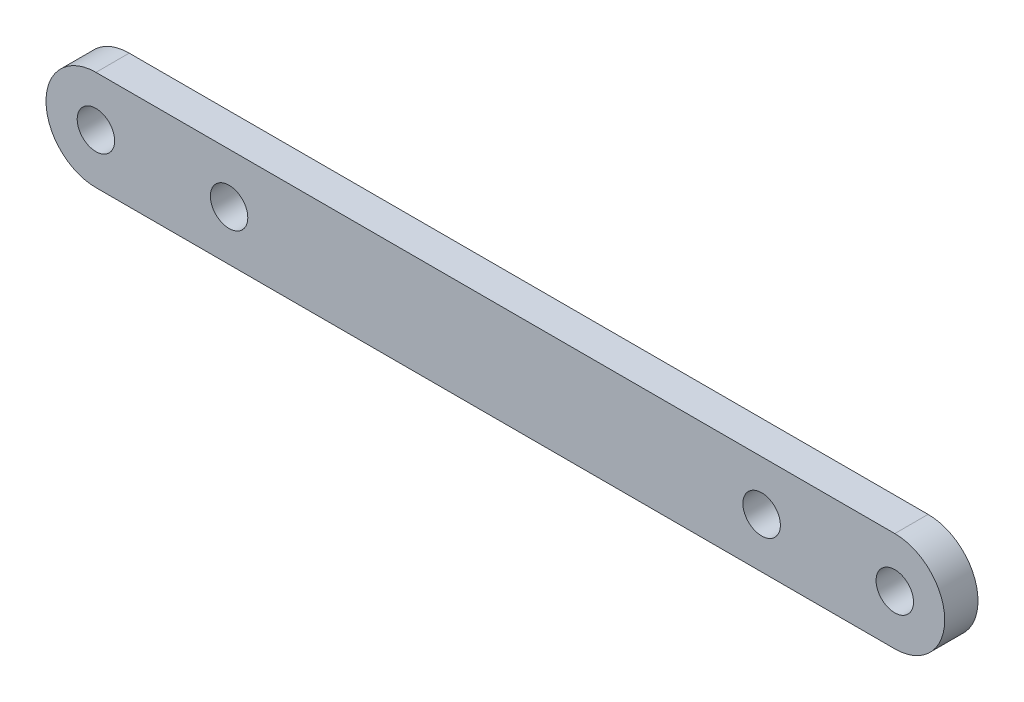
ISO-10303-21;
HEADER;
FILE_DESCRIPTION(('STEP AP214'),'2;1');
FILE_NAME('part.step','',(''),(''),'','','');
FILE_SCHEMA(('AUTOMOTIVE_DESIGN { 1 0 10303 214 1 1 1 1 }'));
ENDSEC;
DATA;
#1=APPLICATION_CONTEXT('core data for automotive mechanical design processes');
#2=APPLICATION_PROTOCOL_DEFINITION('international standard','automotive_design',2000,#1);
#3=PRODUCT_CONTEXT('',#1,'mechanical');
#4=PRODUCT('Part','Part','',(#3));
#5=PRODUCT_RELATED_PRODUCT_CATEGORY('part','',(#4));
#6=PRODUCT_DEFINITION_FORMATION('','',#4);
#7=PRODUCT_DEFINITION_CONTEXT('part definition',#1,'design');
#8=PRODUCT_DEFINITION('design','',#6,#7);
#9=PRODUCT_DEFINITION_SHAPE('','',#8);
#10=(LENGTH_UNIT() NAMED_UNIT(*) SI_UNIT(.MILLI.,.METRE.));
#11=(NAMED_UNIT(*) PLANE_ANGLE_UNIT() SI_UNIT($,.RADIAN.));
#12=(NAMED_UNIT(*) SI_UNIT($,.STERADIAN.) SOLID_ANGLE_UNIT());
#13=UNCERTAINTY_MEASURE_WITH_UNIT(LENGTH_MEASURE(1.E-05),#10,'distance_accuracy_value','');
#14=(GEOMETRIC_REPRESENTATION_CONTEXT(3) GLOBAL_UNCERTAINTY_ASSIGNED_CONTEXT((#13)) GLOBAL_UNIT_ASSIGNED_CONTEXT((#10,
#11,#12)) REPRESENTATION_CONTEXT('',''));
#15=CARTESIAN_POINT('',(0.,0.,0.));
#16=DIRECTION('',(0.,0.,1.));
#17=DIRECTION('',(1.,0.,0.));
#18=AXIS2_PLACEMENT_3D('',#15,#16,#17);
#19=CARTESIAN_POINT('',(0.,0.,3.175));
#20=DIRECTION('',(0.,0.,-1.));
#21=DIRECTION('',(-1.,0.,0.));
#22=AXIS2_PLACEMENT_3D('',#19,#20,#21);
#23=CYLINDRICAL_SURFACE('',#22,4.7625);
#24=CARTESIAN_POINT('',(0.,0.,0.));
#25=DIRECTION('',(0.,0.,1.));
#26=DIRECTION('',(1.,0.,0.));
#27=AXIS2_PLACEMENT_3D('',#24,#25,#26);
#28=CIRCLE('',#27,4.7625);
#29=CARTESIAN_POINT('',(0.,-4.7625,0.));
#30=VERTEX_POINT('',#29);
#31=CARTESIAN_POINT('',(0.,4.7625,0.));
#32=VERTEX_POINT('',#31);
#33=EDGE_CURVE('E95',#30,#32,#28,.T.);
#34=ORIENTED_EDGE('',*,*,#33,.T.);
#35=DIRECTION('',(0.,0.,-1.));
#36=VECTOR('',#35,1.);
#37=CARTESIAN_POINT('',(0.,4.7625,3.175));
#38=LINE('',#37,#36);
#39=CARTESIAN_POINT('',(0.,4.7625,3.175));
#40=VERTEX_POINT('',#39);
#41=EDGE_CURVE('E11',#40,#32,#38,.T.);
#42=ORIENTED_EDGE('',*,*,#41,.F.);
#43=CARTESIAN_POINT('',(0.,0.,3.175));
#44=DIRECTION('',(0.,0.,1.));
#45=DIRECTION('',(1.,0.,0.));
#46=AXIS2_PLACEMENT_3D('',#43,#44,#45);
#47=CIRCLE('',#46,4.7625);
#48=CARTESIAN_POINT('',(0.,-4.7625,3.175));
#49=VERTEX_POINT('',#48);
#50=EDGE_CURVE('E83',#49,#40,#47,.T.);
#51=ORIENTED_EDGE('',*,*,#50,.F.);
#52=DIRECTION('',(0.,0.,-1.));
#53=VECTOR('',#52,1.);
#54=CARTESIAN_POINT('',(0.,-4.7625,3.175));
#55=LINE('',#54,#53);
#56=EDGE_CURVE('E91',#49,#30,#55,.T.);
#57=ORIENTED_EDGE('',*,*,#56,.T.);
#58=EDGE_LOOP('',(#34,#42,#51,#57));
#59=FACE_BOUND('',#58,.T.);
#60=ADVANCED_FACE('F32',(#59),#23,.T.);
#61=CARTESIAN_POINT('',(0.,4.7625,3.175));
#62=DIRECTION('',(0.,-1.,0.));
#63=DIRECTION('',(1.,0.,0.));
#64=AXIS2_PLACEMENT_3D('',#61,#62,#63);
#65=PLANE('',#64);
#66=DIRECTION('',(-1.,0.,0.));
#67=VECTOR('',#66,1.);
#68=CARTESIAN_POINT('',(0.,4.7625,0.));
#69=LINE('',#68,#67);
#70=CARTESIAN_POINT('',(-76.2,4.7625,0.));
#71=VERTEX_POINT('',#70);
#72=EDGE_CURVE('E87',#32,#71,#69,.T.);
#73=ORIENTED_EDGE('',*,*,#72,.T.);
#74=DIRECTION('',(0.,0.,-1.));
#75=VECTOR('',#74,1.);
#76=CARTESIAN_POINT('',(-76.2,4.7625,3.175));
#77=LINE('',#76,#75);
#78=CARTESIAN_POINT('',(-76.2,4.7625,3.175));
#79=VERTEX_POINT('',#78);
#80=EDGE_CURVE('E40',#79,#71,#77,.T.);
#81=ORIENTED_EDGE('',*,*,#80,.F.);
#82=DIRECTION('',(-1.,0.,0.));
#83=VECTOR('',#82,1.);
#84=CARTESIAN_POINT('',(0.,4.7625,3.175));
#85=LINE('',#84,#83);
#86=EDGE_CURVE('E78',#40,#79,#85,.T.);
#87=ORIENTED_EDGE('',*,*,#86,.F.);
#88=ORIENTED_EDGE('',*,*,#41,.T.);
#89=EDGE_LOOP('',(#73,#81,#87,#88));
#90=FACE_BOUND('',#89,.T.);
#91=ADVANCED_FACE('F86',(#90),#65,.F.);
#92=CARTESIAN_POINT('',(-76.2,0.,3.175));
#93=DIRECTION('',(0.,0.,-1.));
#94=DIRECTION('',(-1.,0.,0.));
#95=AXIS2_PLACEMENT_3D('',#92,#93,#94);
#96=CYLINDRICAL_SURFACE('',#95,4.7625);
#97=CARTESIAN_POINT('',(-76.2,0.,0.));
#98=DIRECTION('',(0.,0.,1.));
#99=DIRECTION('',(1.,0.,0.));
#100=AXIS2_PLACEMENT_3D('',#97,#98,#99);
#101=CIRCLE('',#100,4.7625);
#102=CARTESIAN_POINT('',(-76.2,-4.7625,0.));
#103=VERTEX_POINT('',#102);
#104=EDGE_CURVE('E65',#71,#103,#101,.T.);
#105=ORIENTED_EDGE('',*,*,#104,.T.);
#106=DIRECTION('',(0.,0.,-1.));
#107=VECTOR('',#106,1.);
#108=CARTESIAN_POINT('',(-76.2,-4.7625,3.175));
#109=LINE('',#108,#107);
#110=CARTESIAN_POINT('',(-76.2,-4.7625,3.175));
#111=VERTEX_POINT('',#110);
#112=EDGE_CURVE('E88',#111,#103,#109,.T.);
#113=ORIENTED_EDGE('',*,*,#112,.F.);
#114=CARTESIAN_POINT('',(-76.2,0.,3.175));
#115=DIRECTION('',(0.,0.,1.));
#116=DIRECTION('',(1.,0.,0.));
#117=AXIS2_PLACEMENT_3D('',#114,#115,#116);
#118=CIRCLE('',#117,4.7625);
#119=EDGE_CURVE('E81',#79,#111,#118,.T.);
#120=ORIENTED_EDGE('',*,*,#119,.F.);
#121=ORIENTED_EDGE('',*,*,#80,.T.);
#122=EDGE_LOOP('',(#105,#113,#120,#121));
#123=FACE_BOUND('',#122,.T.);
#124=ADVANCED_FACE('F89',(#123),#96,.T.);
#125=CARTESIAN_POINT('',(0.,-4.7625,3.175));
#126=DIRECTION('',(0.,1.,0.));
#127=DIRECTION('',(-1.,0.,0.));
#128=AXIS2_PLACEMENT_3D('',#125,#126,#127);
#129=PLANE('',#128);
#130=DIRECTION('',(1.,0.,0.));
#131=VECTOR('',#130,1.);
#132=CARTESIAN_POINT('',(0.,-4.7625,0.));
#133=LINE('',#132,#131);
#134=EDGE_CURVE('E71',#103,#30,#133,.T.);
#135=ORIENTED_EDGE('',*,*,#134,.T.);
#136=ORIENTED_EDGE('',*,*,#56,.F.);
#137=DIRECTION('',(1.,0.,0.));
#138=VECTOR('',#137,1.);
#139=CARTESIAN_POINT('',(0.,-4.7625,3.175));
#140=LINE('',#139,#138);
#141=EDGE_CURVE('E48',#111,#49,#140,.T.);
#142=ORIENTED_EDGE('',*,*,#141,.F.);
#143=ORIENTED_EDGE('',*,*,#112,.T.);
#144=EDGE_LOOP('',(#135,#136,#142,#143));
#145=FACE_BOUND('',#144,.T.);
#146=ADVANCED_FACE('F103',(#145),#129,.F.);
#147=CARTESIAN_POINT('',(0.,0.,3.175));
#148=DIRECTION('',(0.,0.,1.));
#149=DIRECTION('',(1.,0.,0.));
#150=AXIS2_PLACEMENT_3D('',#147,#148,#149);
#151=PLANE('',#150);
#152=CARTESIAN_POINT('',(-12.7,0.,3.175));
#153=DIRECTION('',(0.,0.,1.));
#154=DIRECTION('',(1.,0.,0.));
#155=AXIS2_PLACEMENT_3D('',#152,#153,#154);
#156=CIRCLE('',#155,1.78600099999999);
#157=CARTESIAN_POINT('',(-10.913999,0.,3.175));
#158=VERTEX_POINT('',#157);
#159=EDGE_CURVE('E129',#158,#158,#156,.T.);
#160=ORIENTED_EDGE('',*,*,#159,.F.);
#161=EDGE_LOOP('',(#160));
#162=FACE_BOUND('',#161,.T.);
#163=CARTESIAN_POINT('',(-63.5,0.,3.175));
#164=DIRECTION('',(0.,0.,1.));
#165=DIRECTION('',(1.,0.,0.));
#166=AXIS2_PLACEMENT_3D('',#163,#164,#165);
#167=CIRCLE('',#166,1.78600099999999);
#168=CARTESIAN_POINT('',(-61.713999,0.,3.175));
#169=VERTEX_POINT('',#168);
#170=EDGE_CURVE('E123',#169,#169,#167,.T.);
#171=ORIENTED_EDGE('',*,*,#170,.F.);
#172=EDGE_LOOP('',(#171));
#173=FACE_BOUND('',#172,.T.);
#174=CARTESIAN_POINT('',(0.,0.,3.175));
#175=DIRECTION('',(0.,0.,1.));
#176=DIRECTION('',(1.,0.,0.));
#177=AXIS2_PLACEMENT_3D('',#174,#175,#176);
#178=CIRCLE('',#177,1.786001);
#179=CARTESIAN_POINT('',(1.786001,0.,3.175));
#180=VERTEX_POINT('',#179);
#181=EDGE_CURVE('E117',#180,#180,#178,.T.);
#182=ORIENTED_EDGE('',*,*,#181,.F.);
#183=EDGE_LOOP('',(#182));
#184=FACE_BOUND('',#183,.T.);
#185=CARTESIAN_POINT('',(-76.2,0.,3.175));
#186=DIRECTION('',(0.,0.,1.));
#187=DIRECTION('',(1.,0.,0.));
#188=AXIS2_PLACEMENT_3D('',#185,#186,#187);
#189=CIRCLE('',#188,1.786001);
#190=CARTESIAN_POINT('',(-74.413999,0.,3.175));
#191=VERTEX_POINT('',#190);
#192=EDGE_CURVE('E111',#191,#191,#189,.T.);
#193=ORIENTED_EDGE('',*,*,#192,.F.);
#194=EDGE_LOOP('',(#193));
#195=FACE_BOUND('',#194,.T.);
#196=ORIENTED_EDGE('',*,*,#50,.T.);
#197=ORIENTED_EDGE('',*,*,#86,.T.);
#198=ORIENTED_EDGE('',*,*,#119,.T.);
#199=ORIENTED_EDGE('',*,*,#141,.T.);
#200=EDGE_LOOP('',(#196,#197,#198,#199));
#201=FACE_BOUND('',#200,.T.);
#202=ADVANCED_FACE('F79',(#162,#173,#184,#195,#201),#151,.T.);
#203=CARTESIAN_POINT('',(0.,0.,0.));
#204=DIRECTION('',(0.,0.,1.));
#205=DIRECTION('',(1.,0.,0.));
#206=AXIS2_PLACEMENT_3D('',#203,#204,#205);
#207=PLANE('',#206);
#208=CARTESIAN_POINT('',(-12.7,0.,0.));
#209=DIRECTION('',(0.,0.,1.));
#210=DIRECTION('',(1.,0.,0.));
#211=AXIS2_PLACEMENT_3D('',#208,#209,#210);
#212=CIRCLE('',#211,1.786001);
#213=CARTESIAN_POINT('',(-10.913999,0.,0.));
#214=VERTEX_POINT('',#213);
#215=EDGE_CURVE('E126',#214,#214,#212,.T.);
#216=ORIENTED_EDGE('',*,*,#215,.T.);
#217=EDGE_LOOP('',(#216));
#218=FACE_BOUND('',#217,.T.);
#219=CARTESIAN_POINT('',(-63.5,0.,0.));
#220=DIRECTION('',(0.,0.,1.));
#221=DIRECTION('',(1.,0.,0.));
#222=AXIS2_PLACEMENT_3D('',#219,#220,#221);
#223=CIRCLE('',#222,1.786001);
#224=CARTESIAN_POINT('',(-61.713999,0.,0.));
#225=VERTEX_POINT('',#224);
#226=EDGE_CURVE('E120',#225,#225,#223,.T.);
#227=ORIENTED_EDGE('',*,*,#226,.T.);
#228=EDGE_LOOP('',(#227));
#229=FACE_BOUND('',#228,.T.);
#230=CARTESIAN_POINT('',(0.,0.,0.));
#231=DIRECTION('',(0.,0.,1.));
#232=DIRECTION('',(1.,0.,0.));
#233=AXIS2_PLACEMENT_3D('',#230,#231,#232);
#234=CIRCLE('',#233,1.786001);
#235=CARTESIAN_POINT('',(1.786001,0.,0.));
#236=VERTEX_POINT('',#235);
#237=EDGE_CURVE('E114',#236,#236,#234,.T.);
#238=ORIENTED_EDGE('',*,*,#237,.T.);
#239=EDGE_LOOP('',(#238));
#240=FACE_BOUND('',#239,.T.);
#241=CARTESIAN_POINT('',(-76.2,0.,0.));
#242=DIRECTION('',(0.,0.,1.));
#243=DIRECTION('',(1.,0.,0.));
#244=AXIS2_PLACEMENT_3D('',#241,#242,#243);
#245=CIRCLE('',#244,1.786001);
#246=CARTESIAN_POINT('',(-74.413999,0.,0.));
#247=VERTEX_POINT('',#246);
#248=EDGE_CURVE('E98',#247,#247,#245,.T.);
#249=ORIENTED_EDGE('',*,*,#248,.T.);
#250=EDGE_LOOP('',(#249));
#251=FACE_BOUND('',#250,.T.);
#252=ORIENTED_EDGE('',*,*,#33,.F.);
#253=ORIENTED_EDGE('',*,*,#134,.F.);
#254=ORIENTED_EDGE('',*,*,#104,.F.);
#255=ORIENTED_EDGE('',*,*,#72,.F.);
#256=EDGE_LOOP('',(#252,#253,#254,#255));
#257=FACE_BOUND('',#256,.T.);
#258=ADVANCED_FACE('F106',(#218,#229,#240,#251,#257),#207,.F.);
#259=CARTESIAN_POINT('',(-76.2,0.,3.175));
#260=DIRECTION('',(0.,0.,1.));
#261=DIRECTION('',(1.,0.,0.));
#262=AXIS2_PLACEMENT_3D('',#259,#260,#261);
#263=CYLINDRICAL_SURFACE('',#262,1.786001);
#264=ORIENTED_EDGE('',*,*,#248,.F.);
#265=EDGE_LOOP('',(#264));
#266=FACE_BOUND('',#265,.T.);
#267=ORIENTED_EDGE('',*,*,#192,.T.);
#268=EDGE_LOOP('',(#267));
#269=FACE_BOUND('',#268,.T.);
#270=ADVANCED_FACE('F144',(#266,#269),#263,.F.);
#271=CARTESIAN_POINT('',(0.,0.,3.175));
#272=DIRECTION('',(0.,0.,1.));
#273=DIRECTION('',(1.,0.,0.));
#274=AXIS2_PLACEMENT_3D('',#271,#272,#273);
#275=CYLINDRICAL_SURFACE('',#274,1.786001);
#276=ORIENTED_EDGE('',*,*,#237,.F.);
#277=EDGE_LOOP('',(#276));
#278=FACE_BOUND('',#277,.T.);
#279=ORIENTED_EDGE('',*,*,#181,.T.);
#280=EDGE_LOOP('',(#279));
#281=FACE_BOUND('',#280,.T.);
#282=ADVANCED_FACE('F146',(#278,#281),#275,.F.);
#283=CARTESIAN_POINT('',(-63.5,0.,3.175));
#284=DIRECTION('',(0.,0.,1.));
#285=DIRECTION('',(1.,0.,0.));
#286=AXIS2_PLACEMENT_3D('',#283,#284,#285);
#287=CYLINDRICAL_SURFACE('',#286,1.78600099999999);
#288=ORIENTED_EDGE('',*,*,#226,.F.);
#289=EDGE_LOOP('',(#288));
#290=FACE_BOUND('',#289,.T.);
#291=ORIENTED_EDGE('',*,*,#170,.T.);
#292=EDGE_LOOP('',(#291));
#293=FACE_BOUND('',#292,.T.);
#294=ADVANCED_FACE('F153',(#290,#293),#287,.F.);
#295=CARTESIAN_POINT('',(-12.7,0.,3.175));
#296=DIRECTION('',(0.,0.,1.));
#297=DIRECTION('',(1.,0.,0.));
#298=AXIS2_PLACEMENT_3D('',#295,#296,#297);
#299=CYLINDRICAL_SURFACE('',#298,1.78600099999999);
#300=ORIENTED_EDGE('',*,*,#215,.F.);
#301=EDGE_LOOP('',(#300));
#302=FACE_BOUND('',#301,.T.);
#303=ORIENTED_EDGE('',*,*,#159,.T.);
#304=EDGE_LOOP('',(#303));
#305=FACE_BOUND('',#304,.T.);
#306=ADVANCED_FACE('F133',(#302,#305),#299,.F.);
#307=CLOSED_SHELL('',(#60,#91,#124,#146,#202,#258,#270,#282,#294,#306));
#308=MANIFOLD_SOLID_BREP('B2',#307);
#309=ADVANCED_BREP_SHAPE_REPRESENTATION('',(#18,#308),#14);
#310=SHAPE_DEFINITION_REPRESENTATION(#9,#309);
ENDSEC;
END-ISO-10303-21;
